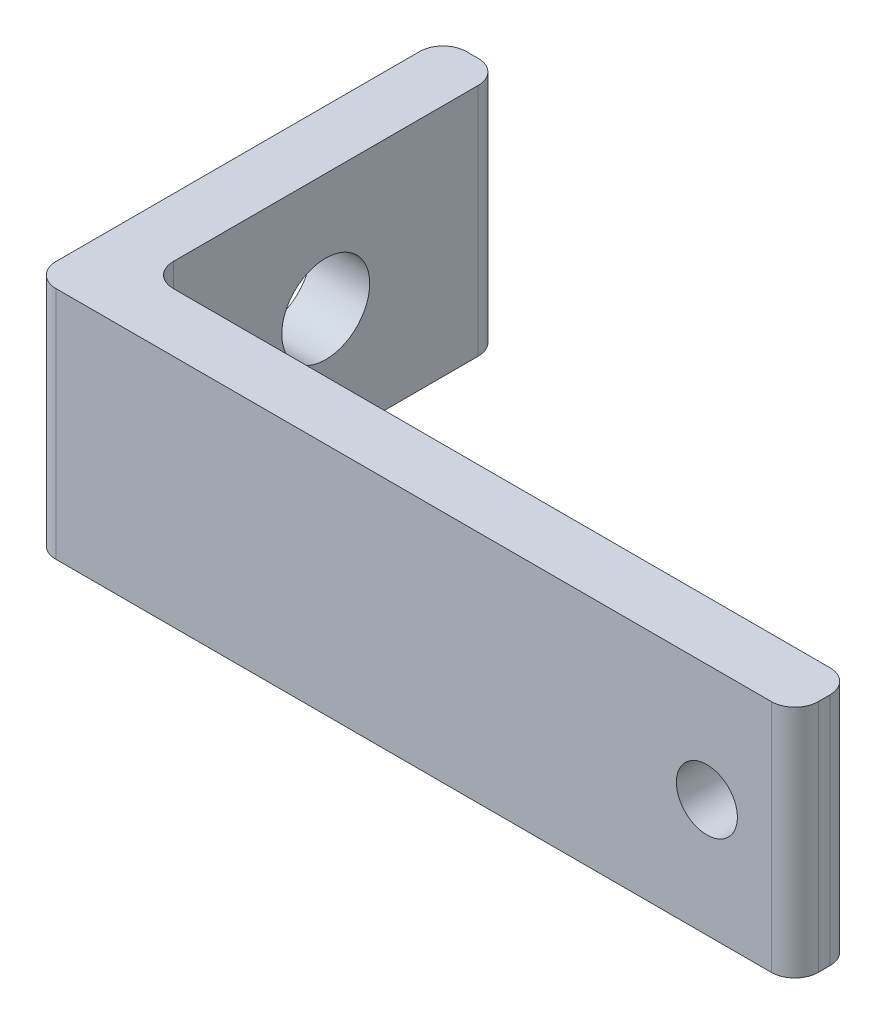
ISO-10303-21;
HEADER;
FILE_DESCRIPTION(('STEP AP214'),'2;1');
FILE_NAME('part.step','',(''),(''),'','','');
FILE_SCHEMA(('AUTOMOTIVE_DESIGN { 1 0 10303 214 1 1 1 1 }'));
ENDSEC;
DATA;
#1=APPLICATION_CONTEXT('core data for automotive mechanical design processes');
#2=APPLICATION_PROTOCOL_DEFINITION('international standard','automotive_design',2000,#1);
#3=PRODUCT_CONTEXT('',#1,'mechanical');
#4=PRODUCT('Part','Part','',(#3));
#5=PRODUCT_RELATED_PRODUCT_CATEGORY('part','',(#4));
#6=PRODUCT_DEFINITION_FORMATION('','',#4);
#7=PRODUCT_DEFINITION_CONTEXT('part definition',#1,'design');
#8=PRODUCT_DEFINITION('design','',#6,#7);
#9=PRODUCT_DEFINITION_SHAPE('','',#8);
#10=(LENGTH_UNIT() NAMED_UNIT(*) SI_UNIT(.MILLI.,.METRE.));
#11=(NAMED_UNIT(*) PLANE_ANGLE_UNIT() SI_UNIT($,.RADIAN.));
#12=(NAMED_UNIT(*) SI_UNIT($,.STERADIAN.) SOLID_ANGLE_UNIT());
#13=UNCERTAINTY_MEASURE_WITH_UNIT(LENGTH_MEASURE(1.E-05),#10,'distance_accuracy_value','');
#14=(GEOMETRIC_REPRESENTATION_CONTEXT(3) GLOBAL_UNCERTAINTY_ASSIGNED_CONTEXT((#13)) GLOBAL_UNIT_ASSIGNED_CONTEXT((#10,
#11,#12)) REPRESENTATION_CONTEXT('',''));
#15=CARTESIAN_POINT('',(0.,0.,0.));
#16=DIRECTION('',(0.,0.,1.));
#17=DIRECTION('',(1.,0.,0.));
#18=AXIS2_PLACEMENT_3D('',#15,#16,#17);
#19=CARTESIAN_POINT('',(0.,25.4,0.));
#20=DIRECTION('',(-1.,0.,0.));
#21=DIRECTION('',(0.,0.,1.));
#22=AXIS2_PLACEMENT_3D('',#19,#20,#21);
#23=PLANE('',#22);
#24=CARTESIAN_POINT('',(0.,12.7,-25.4));
#25=DIRECTION('',(1.,0.,0.));
#26=DIRECTION('',(0.,0.,-1.));
#27=AXIS2_PLACEMENT_3D('',#24,#25,#26);
#28=CIRCLE('',#27,4.7625);
#29=CARTESIAN_POINT('',(0.,12.7,-30.1625));
#30=VERTEX_POINT('',#29);
#31=EDGE_CURVE('E406',#30,#30,#28,.T.);
#32=ORIENTED_EDGE('',*,*,#31,.T.);
#33=EDGE_LOOP('',(#32));
#34=FACE_BOUND('',#33,.T.);
#35=DIRECTION('',(0.,0.,-1.));
#36=VECTOR('',#35,1.);
#37=CARTESIAN_POINT('',(0.,25.4,0.));
#38=LINE('',#37,#36);
#39=CARTESIAN_POINT('',(0.,25.4,-2.54));
#40=VERTEX_POINT('',#39);
#41=CARTESIAN_POINT('',(0.,25.4,-41.91));
#42=VERTEX_POINT('',#41);
#43=EDGE_CURVE('E221',#40,#42,#38,.T.);
#44=ORIENTED_EDGE('',*,*,#43,.T.);
#45=DIRECTION('',(0.,-1.,0.));
#46=VECTOR('',#45,1.);
#47=CARTESIAN_POINT('',(0.,25.4,-41.91));
#48=LINE('',#47,#46);
#49=CARTESIAN_POINT('',(0.,0.,-41.91));
#50=VERTEX_POINT('',#49);
#51=EDGE_CURVE('E143',#42,#50,#48,.T.);
#52=ORIENTED_EDGE('',*,*,#51,.T.);
#53=DIRECTION('',(0.,0.,-1.));
#54=VECTOR('',#53,1.);
#55=CARTESIAN_POINT('',(0.,0.,0.));
#56=LINE('',#55,#54);
#57=CARTESIAN_POINT('',(0.,0.,-2.54));
#58=VERTEX_POINT('',#57);
#59=EDGE_CURVE('E127',#58,#50,#56,.T.);
#60=ORIENTED_EDGE('',*,*,#59,.F.);
#61=DIRECTION('',(0.,-1.,0.));
#62=VECTOR('',#61,1.);
#63=CARTESIAN_POINT('',(0.,25.4,-2.54));
#64=LINE('',#63,#62);
#65=EDGE_CURVE('E140',#58,#40,#64,.F.);
#66=ORIENTED_EDGE('',*,*,#65,.T.);
#67=EDGE_LOOP('',(#44,#52,#60,#66));
#68=FACE_BOUND('',#67,.T.);
#69=ADVANCED_FACE('F35',(#34,#68),#23,.T.);
#70=CARTESIAN_POINT('',(0.,25.4,0.));
#71=DIRECTION('',(0.,0.,-1.));
#72=DIRECTION('',(-1.,0.,0.));
#73=AXIS2_PLACEMENT_3D('',#70,#71,#72);
#74=PLANE('',#73);
#75=CARTESIAN_POINT('',(73.025,12.7,0.));
#76=DIRECTION('',(0.,0.,-1.));
#77=DIRECTION('',(-1.,0.,0.));
#78=AXIS2_PLACEMENT_3D('',#75,#76,#77);
#79=CIRCLE('',#78,3.302);
#80=CARTESIAN_POINT('',(69.723,12.7,0.));
#81=VERTEX_POINT('',#80);
#82=EDGE_CURVE('E144',#81,#81,#79,.T.);
#83=ORIENTED_EDGE('',*,*,#82,.T.);
#84=EDGE_LOOP('',(#83));
#85=FACE_BOUND('',#84,.T.);
#86=DIRECTION('',(1.,0.,0.));
#87=VECTOR('',#86,1.);
#88=CARTESIAN_POINT('',(0.,0.,0.));
#89=LINE('',#88,#87);
#90=CARTESIAN_POINT('',(2.54,0.,0.));
#91=VERTEX_POINT('',#90);
#92=CARTESIAN_POINT('',(80.01,0.,0.));
#93=VERTEX_POINT('',#92);
#94=EDGE_CURVE('E129',#91,#93,#89,.T.);
#95=ORIENTED_EDGE('',*,*,#94,.T.);
#96=DIRECTION('',(0.,-1.,0.));
#97=VECTOR('',#96,1.);
#98=CARTESIAN_POINT('',(80.01,25.4,0.));
#99=LINE('',#98,#97);
#100=CARTESIAN_POINT('',(80.01,25.4,0.));
#101=VERTEX_POINT('',#100);
#102=EDGE_CURVE('E186',#93,#101,#99,.F.);
#103=ORIENTED_EDGE('',*,*,#102,.T.);
#104=DIRECTION('',(1.,0.,0.));
#105=VECTOR('',#104,1.);
#106=CARTESIAN_POINT('',(0.,25.4,0.));
#107=LINE('',#106,#105);
#108=CARTESIAN_POINT('',(2.54,25.4,0.));
#109=VERTEX_POINT('',#108);
#110=EDGE_CURVE('E223',#109,#101,#107,.T.);
#111=ORIENTED_EDGE('',*,*,#110,.F.);
#112=DIRECTION('',(0.,-1.,0.));
#113=VECTOR('',#112,1.);
#114=CARTESIAN_POINT('',(2.54,0.,0.));
#115=LINE('',#114,#113);
#116=EDGE_CURVE('E184',#109,#91,#115,.T.);
#117=ORIENTED_EDGE('',*,*,#116,.T.);
#118=EDGE_LOOP('',(#95,#103,#111,#117));
#119=FACE_BOUND('',#118,.T.);
#120=ADVANCED_FACE('F247',(#85,#119),#74,.F.);
#121=CARTESIAN_POINT('',(82.55,25.4,0.));
#122=DIRECTION('',(-1.,0.,0.));
#123=DIRECTION('',(0.,0.,1.));
#124=AXIS2_PLACEMENT_3D('',#121,#122,#123);
#125=PLANE('',#124);
#126=DIRECTION('',(0.,0.,-1.));
#127=VECTOR('',#126,1.);
#128=CARTESIAN_POINT('',(82.55,25.4,0.));
#129=LINE('',#128,#127);
#130=CARTESIAN_POINT('',(82.55,25.4,-2.54));
#131=VERTEX_POINT('',#130);
#132=CARTESIAN_POINT('',(82.55,25.4,-3.81));
#133=VERTEX_POINT('',#132);
#134=EDGE_CURVE('E214',#131,#133,#129,.T.);
#135=ORIENTED_EDGE('',*,*,#134,.F.);
#136=DIRECTION('',(0.,-1.,0.));
#137=VECTOR('',#136,1.);
#138=CARTESIAN_POINT('',(82.55,25.4,-2.54));
#139=LINE('',#138,#137);
#140=CARTESIAN_POINT('',(82.55,0.,-2.54));
#141=VERTEX_POINT('',#140);
#142=EDGE_CURVE('E181',#131,#141,#139,.T.);
#143=ORIENTED_EDGE('',*,*,#142,.T.);
#144=DIRECTION('',(0.,0.,-1.));
#145=VECTOR('',#144,1.);
#146=CARTESIAN_POINT('',(82.55,0.,0.));
#147=LINE('',#146,#145);
#148=CARTESIAN_POINT('',(82.55,0.,-3.81));
#149=VERTEX_POINT('',#148);
#150=EDGE_CURVE('E208',#141,#149,#147,.T.);
#151=ORIENTED_EDGE('',*,*,#150,.T.);
#152=DIRECTION('',(0.,-1.,0.));
#153=VECTOR('',#152,1.);
#154=CARTESIAN_POINT('',(82.55,25.4,-3.81));
#155=LINE('',#154,#153);
#156=EDGE_CURVE('E179',#149,#133,#155,.F.);
#157=ORIENTED_EDGE('',*,*,#156,.T.);
#158=EDGE_LOOP('',(#135,#143,#151,#157));
#159=FACE_BOUND('',#158,.T.);
#160=ADVANCED_FACE('F242',(#159),#125,.F.);
#161=CARTESIAN_POINT('',(0.,25.4,-6.35));
#162=DIRECTION('',(0.,0.,-1.));
#163=DIRECTION('',(-1.,0.,0.));
#164=AXIS2_PLACEMENT_3D('',#161,#162,#163);
#165=PLANE('',#164);
#166=CARTESIAN_POINT('',(73.025,12.7,-6.35));
#167=DIRECTION('',(0.,0.,-1.));
#168=DIRECTION('',(-1.,0.,0.));
#169=AXIS2_PLACEMENT_3D('',#166,#167,#168);
#170=CIRCLE('',#169,3.302);
#171=CARTESIAN_POINT('',(69.723,12.7,-6.35));
#172=VERTEX_POINT('',#171);
#173=EDGE_CURVE('E228',#172,#172,#170,.T.);
#174=ORIENTED_EDGE('',*,*,#173,.F.);
#175=EDGE_LOOP('',(#174));
#176=FACE_BOUND('',#175,.T.);
#177=DIRECTION('',(1.,0.,0.));
#178=VECTOR('',#177,1.);
#179=CARTESIAN_POINT('',(0.,25.4,-6.35));
#180=LINE('',#179,#178);
#181=CARTESIAN_POINT('',(8.89,25.4,-6.35));
#182=VERTEX_POINT('',#181);
#183=CARTESIAN_POINT('',(80.01,25.4,-6.35));
#184=VERTEX_POINT('',#183);
#185=EDGE_CURVE('E212',#182,#184,#180,.T.);
#186=ORIENTED_EDGE('',*,*,#185,.T.);
#187=DIRECTION('',(0.,-1.,0.));
#188=VECTOR('',#187,1.);
#189=CARTESIAN_POINT('',(80.01,0.,-6.35));
#190=LINE('',#189,#188);
#191=CARTESIAN_POINT('',(80.01,0.,-6.35));
#192=VERTEX_POINT('',#191);
#193=EDGE_CURVE('E194',#184,#192,#190,.T.);
#194=ORIENTED_EDGE('',*,*,#193,.T.);
#195=DIRECTION('',(1.,0.,0.));
#196=VECTOR('',#195,1.);
#197=CARTESIAN_POINT('',(0.,0.,-6.35));
#198=LINE('',#197,#196);
#199=CARTESIAN_POINT('',(8.89,0.,-6.35));
#200=VERTEX_POINT('',#199);
#201=EDGE_CURVE('E199',#200,#192,#198,.T.);
#202=ORIENTED_EDGE('',*,*,#201,.F.);
#203=DIRECTION('',(0.,-1.,0.));
#204=VECTOR('',#203,1.);
#205=CARTESIAN_POINT('',(8.89,25.4,-6.35));
#206=LINE('',#205,#204);
#207=EDGE_CURVE('E192',#200,#182,#206,.F.);
#208=ORIENTED_EDGE('',*,*,#207,.T.);
#209=EDGE_LOOP('',(#186,#194,#202,#208));
#210=FACE_BOUND('',#209,.T.);
#211=ADVANCED_FACE('F206',(#176,#210),#165,.T.);
#212=CARTESIAN_POINT('',(6.35,25.4,0.));
#213=DIRECTION('',(-1.,0.,0.));
#214=DIRECTION('',(0.,0.,1.));
#215=AXIS2_PLACEMENT_3D('',#212,#213,#214);
#216=PLANE('',#215);
#217=CARTESIAN_POINT('',(6.35,12.7,-25.4));
#218=DIRECTION('',(1.,0.,0.));
#219=DIRECTION('',(0.,0.,-1.));
#220=AXIS2_PLACEMENT_3D('',#217,#218,#219);
#221=CIRCLE('',#220,4.7625);
#222=CARTESIAN_POINT('',(6.35,12.7,-30.1625));
#223=VERTEX_POINT('',#222);
#224=EDGE_CURVE('E408',#223,#223,#221,.T.);
#225=ORIENTED_EDGE('',*,*,#224,.F.);
#226=EDGE_LOOP('',(#225));
#227=FACE_BOUND('',#226,.T.);
#228=DIRECTION('',(0.,0.,-1.));
#229=VECTOR('',#228,1.);
#230=CARTESIAN_POINT('',(6.35,0.,0.));
#231=LINE('',#230,#229);
#232=CARTESIAN_POINT('',(6.35,0.,-8.89));
#233=VERTEX_POINT('',#232);
#234=CARTESIAN_POINT('',(6.35,0.,-41.91));
#235=VERTEX_POINT('',#234);
#236=EDGE_CURVE('E200',#233,#235,#231,.T.);
#237=ORIENTED_EDGE('',*,*,#236,.T.);
#238=DIRECTION('',(0.,-1.,0.));
#239=VECTOR('',#238,1.);
#240=CARTESIAN_POINT('',(6.35,25.4,-41.91));
#241=LINE('',#240,#239);
#242=CARTESIAN_POINT('',(6.35,25.4,-41.91));
#243=VERTEX_POINT('',#242);
#244=EDGE_CURVE('E50',#235,#243,#241,.F.);
#245=ORIENTED_EDGE('',*,*,#244,.T.);
#246=DIRECTION('',(0.,0.,-1.));
#247=VECTOR('',#246,1.);
#248=CARTESIAN_POINT('',(6.35,25.4,0.));
#249=LINE('',#248,#247);
#250=CARTESIAN_POINT('',(6.35,25.4,-8.89));
#251=VERTEX_POINT('',#250);
#252=EDGE_CURVE('E154',#251,#243,#249,.T.);
#253=ORIENTED_EDGE('',*,*,#252,.F.);
#254=DIRECTION('',(0.,-1.,0.));
#255=VECTOR('',#254,1.);
#256=CARTESIAN_POINT('',(6.35,25.4,-8.89));
#257=LINE('',#256,#255);
#258=EDGE_CURVE('E188',#251,#233,#257,.T.);
#259=ORIENTED_EDGE('',*,*,#258,.T.);
#260=EDGE_LOOP('',(#237,#245,#253,#259));
#261=FACE_BOUND('',#260,.T.);
#262=ADVANCED_FACE('F210',(#227,#261),#216,.F.);
#263=CARTESIAN_POINT('',(0.,25.4,-44.45));
#264=DIRECTION('',(0.,0.,-1.));
#265=DIRECTION('',(-1.,0.,0.));
#266=AXIS2_PLACEMENT_3D('',#263,#264,#265);
#267=PLANE('',#266);
#268=DIRECTION('',(1.,0.,0.));
#269=VECTOR('',#268,1.);
#270=CARTESIAN_POINT('',(0.,0.,-44.45));
#271=LINE('',#270,#269);
#272=CARTESIAN_POINT('',(2.54,0.,-44.45));
#273=VERTEX_POINT('',#272);
#274=CARTESIAN_POINT('',(3.81,0.,-44.45));
#275=VERTEX_POINT('',#274);
#276=EDGE_CURVE('E157',#273,#275,#271,.T.);
#277=ORIENTED_EDGE('',*,*,#276,.F.);
#278=DIRECTION('',(0.,-1.,0.));
#279=VECTOR('',#278,1.);
#280=CARTESIAN_POINT('',(2.54,25.4,-44.45));
#281=LINE('',#280,#279);
#282=CARTESIAN_POINT('',(2.54,25.4,-44.45));
#283=VERTEX_POINT('',#282);
#284=EDGE_CURVE('E168',#273,#283,#281,.F.);
#285=ORIENTED_EDGE('',*,*,#284,.T.);
#286=DIRECTION('',(1.,0.,0.));
#287=VECTOR('',#286,1.);
#288=CARTESIAN_POINT('',(0.,25.4,-44.45));
#289=LINE('',#288,#287);
#290=CARTESIAN_POINT('',(3.81,25.4,-44.45));
#291=VERTEX_POINT('',#290);
#292=EDGE_CURVE('E149',#283,#291,#289,.T.);
#293=ORIENTED_EDGE('',*,*,#292,.T.);
#294=DIRECTION('',(0.,-1.,0.));
#295=VECTOR('',#294,1.);
#296=CARTESIAN_POINT('',(3.81,0.,-44.45));
#297=LINE('',#296,#295);
#298=EDGE_CURVE('E165',#291,#275,#297,.T.);
#299=ORIENTED_EDGE('',*,*,#298,.T.);
#300=EDGE_LOOP('',(#277,#285,#293,#299));
#301=FACE_BOUND('',#300,.T.);
#302=ADVANCED_FACE('F254',(#301),#267,.T.);
#303=CARTESIAN_POINT('',(0.,25.4,0.));
#304=DIRECTION('',(0.,1.,0.));
#305=DIRECTION('',(0.,0.,1.));
#306=AXIS2_PLACEMENT_3D('',#303,#304,#305);
#307=PLANE('',#306);
#308=ORIENTED_EDGE('',*,*,#292,.F.);
#309=CARTESIAN_POINT('',(2.54,25.4,-41.91));
#310=DIRECTION('',(0.,1.,0.));
#311=DIRECTION('',(0.,0.,1.));
#312=AXIS2_PLACEMENT_3D('',#309,#310,#311);
#313=CIRCLE('',#312,2.54);
#314=EDGE_CURVE('E177',#283,#42,#313,.T.);
#315=ORIENTED_EDGE('',*,*,#314,.T.);
#316=ORIENTED_EDGE('',*,*,#43,.F.);
#317=CARTESIAN_POINT('',(2.54,25.4,-2.54));
#318=DIRECTION('',(0.,1.,0.));
#319=DIRECTION('',(0.,0.,1.));
#320=AXIS2_PLACEMENT_3D('',#317,#318,#319);
#321=CIRCLE('',#320,2.54);
#322=EDGE_CURVE('E148',#40,#109,#321,.T.);
#323=ORIENTED_EDGE('',*,*,#322,.T.);
#324=ORIENTED_EDGE('',*,*,#110,.T.);
#325=CARTESIAN_POINT('',(80.01,25.4,-2.54));
#326=DIRECTION('',(0.,1.,0.));
#327=DIRECTION('',(0.,0.,1.));
#328=AXIS2_PLACEMENT_3D('',#325,#326,#327);
#329=CIRCLE('',#328,2.54);
#330=EDGE_CURVE('E175',#101,#131,#329,.T.);
#331=ORIENTED_EDGE('',*,*,#330,.T.);
#332=ORIENTED_EDGE('',*,*,#134,.T.);
#333=CARTESIAN_POINT('',(80.01,25.4,-3.81));
#334=DIRECTION('',(0.,1.,0.));
#335=DIRECTION('',(0.,0.,1.));
#336=AXIS2_PLACEMENT_3D('',#333,#334,#335);
#337=CIRCLE('',#336,2.54);
#338=EDGE_CURVE('E170',#133,#184,#337,.T.);
#339=ORIENTED_EDGE('',*,*,#338,.T.);
#340=ORIENTED_EDGE('',*,*,#185,.F.);
#341=CARTESIAN_POINT('',(8.89,25.4,-8.89));
#342=DIRECTION('',(0.,1.,0.));
#343=DIRECTION('',(0.,0.,1.));
#344=AXIS2_PLACEMENT_3D('',#341,#342,#343);
#345=CIRCLE('',#344,2.54);
#346=EDGE_CURVE('E11',#182,#251,#345,.F.);
#347=ORIENTED_EDGE('',*,*,#346,.T.);
#348=ORIENTED_EDGE('',*,*,#252,.T.);
#349=CARTESIAN_POINT('',(3.81,25.4,-41.91));
#350=DIRECTION('',(0.,1.,0.));
#351=DIRECTION('',(0.,0.,1.));
#352=AXIS2_PLACEMENT_3D('',#349,#350,#351);
#353=CIRCLE('',#352,2.54);
#354=EDGE_CURVE('E172',#243,#291,#353,.T.);
#355=ORIENTED_EDGE('',*,*,#354,.T.);
#356=EDGE_LOOP('',(#308,#315,#316,#323,#324,#331,#332,#339,#340,#347,#348,#355));
#357=FACE_BOUND('',#356,.T.);
#358=ADVANCED_FACE('F234',(#357),#307,.T.);
#359=CARTESIAN_POINT('',(0.,0.,0.));
#360=DIRECTION('',(0.,1.,0.));
#361=DIRECTION('',(0.,0.,1.));
#362=AXIS2_PLACEMENT_3D('',#359,#360,#361);
#363=PLANE('',#362);
#364=ORIENTED_EDGE('',*,*,#59,.T.);
#365=CARTESIAN_POINT('',(2.54,0.,-41.91));
#366=DIRECTION('',(0.,1.,0.));
#367=DIRECTION('',(0.,0.,1.));
#368=AXIS2_PLACEMENT_3D('',#365,#366,#367);
#369=CIRCLE('',#368,2.54);
#370=EDGE_CURVE('E163',#50,#273,#369,.F.);
#371=ORIENTED_EDGE('',*,*,#370,.T.);
#372=ORIENTED_EDGE('',*,*,#276,.T.);
#373=CARTESIAN_POINT('',(3.81,0.,-41.91));
#374=DIRECTION('',(0.,1.,0.));
#375=DIRECTION('',(0.,0.,1.));
#376=AXIS2_PLACEMENT_3D('',#373,#374,#375);
#377=CIRCLE('',#376,2.54);
#378=EDGE_CURVE('E135',#275,#235,#377,.F.);
#379=ORIENTED_EDGE('',*,*,#378,.T.);
#380=ORIENTED_EDGE('',*,*,#236,.F.);
#381=CARTESIAN_POINT('',(8.89,0.,-8.89));
#382=DIRECTION('',(0.,1.,0.));
#383=DIRECTION('',(0.,0.,1.));
#384=AXIS2_PLACEMENT_3D('',#381,#382,#383);
#385=CIRCLE('',#384,2.54);
#386=EDGE_CURVE('E43',#233,#200,#385,.T.);
#387=ORIENTED_EDGE('',*,*,#386,.T.);
#388=ORIENTED_EDGE('',*,*,#201,.T.);
#389=CARTESIAN_POINT('',(80.01,0.,-3.81));
#390=DIRECTION('',(0.,1.,0.));
#391=DIRECTION('',(0.,0.,1.));
#392=AXIS2_PLACEMENT_3D('',#389,#390,#391);
#393=CIRCLE('',#392,2.54);
#394=EDGE_CURVE('E151',#192,#149,#393,.F.);
#395=ORIENTED_EDGE('',*,*,#394,.T.);
#396=ORIENTED_EDGE('',*,*,#150,.F.);
#397=CARTESIAN_POINT('',(80.01,0.,-2.54));
#398=DIRECTION('',(0.,1.,0.));
#399=DIRECTION('',(0.,0.,1.));
#400=AXIS2_PLACEMENT_3D('',#397,#398,#399);
#401=CIRCLE('',#400,2.54);
#402=EDGE_CURVE('E134',#141,#93,#401,.F.);
#403=ORIENTED_EDGE('',*,*,#402,.T.);
#404=ORIENTED_EDGE('',*,*,#94,.F.);
#405=CARTESIAN_POINT('',(2.54,0.,-2.54));
#406=DIRECTION('',(0.,1.,0.));
#407=DIRECTION('',(0.,0.,1.));
#408=AXIS2_PLACEMENT_3D('',#405,#406,#407);
#409=CIRCLE('',#408,2.54);
#410=EDGE_CURVE('E124',#91,#58,#409,.F.);
#411=ORIENTED_EDGE('',*,*,#410,.T.);
#412=EDGE_LOOP('',(#364,#371,#372,#379,#380,#387,#388,#395,#396,#403,#404,#411));
#413=FACE_BOUND('',#412,.T.);
#414=ADVANCED_FACE('F126',(#413),#363,.F.);
#415=CARTESIAN_POINT('',(73.025,12.7,0.));
#416=DIRECTION('',(0.,0.,-1.));
#417=DIRECTION('',(-1.,0.,0.));
#418=AXIS2_PLACEMENT_3D('',#415,#416,#417);
#419=CYLINDRICAL_SURFACE('',#418,3.302);
#420=ORIENTED_EDGE('',*,*,#82,.F.);
#421=EDGE_LOOP('',(#420));
#422=FACE_BOUND('',#421,.T.);
#423=ORIENTED_EDGE('',*,*,#173,.T.);
#424=EDGE_LOOP('',(#423));
#425=FACE_BOUND('',#424,.T.);
#426=ADVANCED_FACE('F322',(#422,#425),#419,.F.);
#427=CARTESIAN_POINT('',(0.,12.7,-25.4));
#428=DIRECTION('',(1.,0.,0.));
#429=DIRECTION('',(0.,0.,-1.));
#430=AXIS2_PLACEMENT_3D('',#427,#428,#429);
#431=CYLINDRICAL_SURFACE('',#430,4.7625);
#432=ORIENTED_EDGE('',*,*,#31,.F.);
#433=EDGE_LOOP('',(#432));
#434=FACE_BOUND('',#433,.T.);
#435=ORIENTED_EDGE('',*,*,#224,.T.);
#436=EDGE_LOOP('',(#435));
#437=FACE_BOUND('',#436,.T.);
#438=ADVANCED_FACE('F278',(#434,#437),#431,.F.);
#439=CARTESIAN_POINT('',(2.54,25.4,-41.91));
#440=DIRECTION('',(0.,-1.,0.));
#441=DIRECTION('',(0.,0.,-1.));
#442=AXIS2_PLACEMENT_3D('',#439,#440,#441);
#443=CYLINDRICAL_SURFACE('',#442,2.54);
#444=ORIENTED_EDGE('',*,*,#314,.F.);
#445=ORIENTED_EDGE('',*,*,#284,.F.);
#446=ORIENTED_EDGE('',*,*,#370,.F.);
#447=ORIENTED_EDGE('',*,*,#51,.F.);
#448=EDGE_LOOP('',(#444,#445,#446,#447));
#449=FACE_BOUND('',#448,.T.);
#450=ADVANCED_FACE('F252',(#449),#443,.T.);
#451=CARTESIAN_POINT('',(80.01,25.4,-2.54));
#452=DIRECTION('',(0.,-1.,0.));
#453=DIRECTION('',(0.,0.,-1.));
#454=AXIS2_PLACEMENT_3D('',#451,#452,#453);
#455=CYLINDRICAL_SURFACE('',#454,2.54);
#456=ORIENTED_EDGE('',*,*,#330,.F.);
#457=ORIENTED_EDGE('',*,*,#102,.F.);
#458=ORIENTED_EDGE('',*,*,#402,.F.);
#459=ORIENTED_EDGE('',*,*,#142,.F.);
#460=EDGE_LOOP('',(#456,#457,#458,#459));
#461=FACE_BOUND('',#460,.T.);
#462=ADVANCED_FACE('F244',(#461),#455,.T.);
#463=CARTESIAN_POINT('',(2.54,25.4,-2.54));
#464=DIRECTION('',(0.,1.,0.));
#465=DIRECTION('',(0.,0.,1.));
#466=AXIS2_PLACEMENT_3D('',#463,#464,#465);
#467=CYLINDRICAL_SURFACE('',#466,2.54);
#468=ORIENTED_EDGE('',*,*,#322,.F.);
#469=ORIENTED_EDGE('',*,*,#65,.F.);
#470=ORIENTED_EDGE('',*,*,#410,.F.);
#471=ORIENTED_EDGE('',*,*,#116,.F.);
#472=EDGE_LOOP('',(#468,#469,#470,#471));
#473=FACE_BOUND('',#472,.T.);
#474=ADVANCED_FACE('F147',(#473),#467,.T.);
#475=CARTESIAN_POINT('',(3.81,25.4,-41.91));
#476=DIRECTION('',(0.,1.,0.));
#477=DIRECTION('',(0.,0.,1.));
#478=AXIS2_PLACEMENT_3D('',#475,#476,#477);
#479=CYLINDRICAL_SURFACE('',#478,2.54);
#480=ORIENTED_EDGE('',*,*,#354,.F.);
#481=ORIENTED_EDGE('',*,*,#244,.F.);
#482=ORIENTED_EDGE('',*,*,#378,.F.);
#483=ORIENTED_EDGE('',*,*,#298,.F.);
#484=EDGE_LOOP('',(#480,#481,#482,#483));
#485=FACE_BOUND('',#484,.T.);
#486=ADVANCED_FACE('F257',(#485),#479,.T.);
#487=CARTESIAN_POINT('',(80.01,25.4,-3.81));
#488=DIRECTION('',(0.,1.,0.));
#489=DIRECTION('',(0.,0.,1.));
#490=AXIS2_PLACEMENT_3D('',#487,#488,#489);
#491=CYLINDRICAL_SURFACE('',#490,2.54);
#492=ORIENTED_EDGE('',*,*,#338,.F.);
#493=ORIENTED_EDGE('',*,*,#156,.F.);
#494=ORIENTED_EDGE('',*,*,#394,.F.);
#495=ORIENTED_EDGE('',*,*,#193,.F.);
#496=EDGE_LOOP('',(#492,#493,#494,#495));
#497=FACE_BOUND('',#496,.T.);
#498=ADVANCED_FACE('F240',(#497),#491,.T.);
#499=CARTESIAN_POINT('',(8.89,25.4,-8.89));
#500=DIRECTION('',(0.,-1.,0.));
#501=DIRECTION('',(0.,0.,-1.));
#502=AXIS2_PLACEMENT_3D('',#499,#500,#501);
#503=CYLINDRICAL_SURFACE('',#502,2.54);
#504=ORIENTED_EDGE('',*,*,#346,.F.);
#505=ORIENTED_EDGE('',*,*,#207,.F.);
#506=ORIENTED_EDGE('',*,*,#386,.F.);
#507=ORIENTED_EDGE('',*,*,#258,.F.);
#508=EDGE_LOOP('',(#504,#505,#506,#507));
#509=FACE_BOUND('',#508,.T.);
#510=ADVANCED_FACE('F37',(#509),#503,.F.);
#511=CLOSED_SHELL('',(#69,#120,#160,#211,#262,#302,#358,#414,#426,#438,#450,#462,#474,#486,#498,#510));
#512=MANIFOLD_SOLID_BREP('B2',#511);
#513=ADVANCED_BREP_SHAPE_REPRESENTATION('',(#18,#512),#14);
#514=SHAPE_DEFINITION_REPRESENTATION(#9,#513);
ENDSEC;
END-ISO-10303-21;
